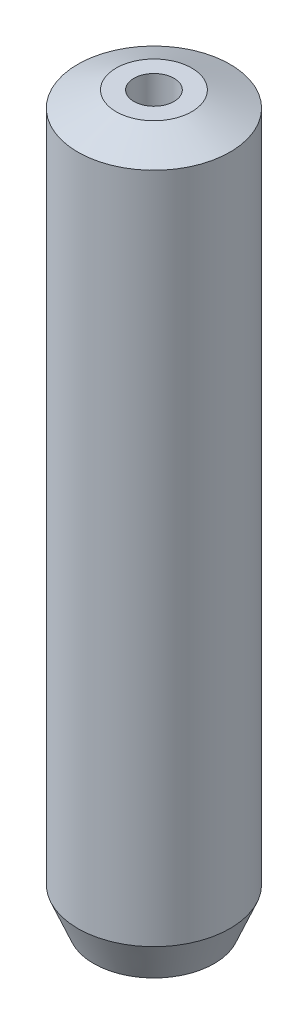
ISO-10303-21;
HEADER;
FILE_DESCRIPTION(('STEP AP214'),'2;1');
FILE_NAME('part.step','',(''),(''),'','','');
FILE_SCHEMA(('AUTOMOTIVE_DESIGN { 1 0 10303 214 1 1 1 1 }'));
ENDSEC;
DATA;
#1=APPLICATION_CONTEXT('core data for automotive mechanical design processes');
#2=APPLICATION_PROTOCOL_DEFINITION('international standard','automotive_design',2000,#1);
#3=PRODUCT_CONTEXT('',#1,'mechanical');
#4=PRODUCT('Part','Part','',(#3));
#5=PRODUCT_RELATED_PRODUCT_CATEGORY('part','',(#4));
#6=PRODUCT_DEFINITION_FORMATION('','',#4);
#7=PRODUCT_DEFINITION_CONTEXT('part definition',#1,'design');
#8=PRODUCT_DEFINITION('design','',#6,#7);
#9=PRODUCT_DEFINITION_SHAPE('','',#8);
#10=(LENGTH_UNIT() NAMED_UNIT(*) SI_UNIT(.MILLI.,.METRE.));
#11=(NAMED_UNIT(*) PLANE_ANGLE_UNIT() SI_UNIT($,.RADIAN.));
#12=(NAMED_UNIT(*) SI_UNIT($,.STERADIAN.) SOLID_ANGLE_UNIT());
#13=UNCERTAINTY_MEASURE_WITH_UNIT(LENGTH_MEASURE(1.E-05),#10,'distance_accuracy_value','');
#14=(GEOMETRIC_REPRESENTATION_CONTEXT(3) GLOBAL_UNCERTAINTY_ASSIGNED_CONTEXT((#13)) GLOBAL_UNIT_ASSIGNED_CONTEXT((#10,
#11,#12)) REPRESENTATION_CONTEXT('',''));
#15=CARTESIAN_POINT('',(0.,0.,0.));
#16=DIRECTION('',(0.,0.,1.));
#17=DIRECTION('',(1.,0.,0.));
#18=AXIS2_PLACEMENT_3D('',#15,#16,#17);
#19=CARTESIAN_POINT('',(0.,47.7138958191525,0.));
#20=DIRECTION('',(0.,-1.,0.));
#21=DIRECTION('',(0.,0.,-1.));
#22=AXIS2_PLACEMENT_3D('',#19,#20,#21);
#23=CYLINDRICAL_SURFACE('',#22,5.);
#24=CARTESIAN_POINT('',(0.,46.6743218122563,0.));
#25=DIRECTION('',(0.,1.,0.));
#26=DIRECTION('',(0.,0.,1.));
#27=AXIS2_PLACEMENT_3D('',#24,#25,#26);
#28=CIRCLE('',#27,5.);
#29=CARTESIAN_POINT('',(0.,46.6743218122563,5.));
#30=VERTEX_POINT('',#29);
#31=EDGE_CURVE('E50',#30,#30,#28,.F.);
#32=ORIENTED_EDGE('',*,*,#31,.T.);
#33=EDGE_LOOP('',(#32));
#34=FACE_BOUND('',#33,.T.);
#35=CARTESIAN_POINT('',(0.,2.51590091484068,0.));
#36=DIRECTION('',(0.,1.,0.));
#37=DIRECTION('',(0.,0.,1.));
#38=AXIS2_PLACEMENT_3D('',#35,#36,#37);
#39=CIRCLE('',#38,5.);
#40=CARTESIAN_POINT('',(0.,2.51590091484068,5.));
#41=VERTEX_POINT('',#40);
#42=EDGE_CURVE('E51',#41,#41,#39,.T.);
#43=ORIENTED_EDGE('',*,*,#42,.T.);
#44=EDGE_LOOP('',(#43));
#45=FACE_BOUND('',#44,.T.);
#46=ADVANCED_FACE('F39',(#34,#45),#23,.T.);
#47=CARTESIAN_POINT('',(0.,47.7138958191525,0.));
#48=DIRECTION('',(0.,1.,0.));
#49=DIRECTION('',(0.,0.,1.));
#50=AXIS2_PLACEMENT_3D('',#47,#48,#49);
#51=PLANE('',#50);
#52=CARTESIAN_POINT('',(0.,47.7138958191525,0.));
#53=DIRECTION('',(0.,1.,0.));
#54=DIRECTION('',(0.,0.,1.));
#55=AXIS2_PLACEMENT_3D('',#52,#53,#54);
#56=CIRCLE('',#55,2.48409908515933);
#57=CARTESIAN_POINT('',(0.,47.7138958191525,2.48409908515933));
#58=VERTEX_POINT('',#57);
#59=EDGE_CURVE('E54',#58,#58,#56,.T.);
#60=ORIENTED_EDGE('',*,*,#59,.T.);
#61=EDGE_LOOP('',(#60));
#62=FACE_BOUND('',#61,.T.);
#63=CARTESIAN_POINT('',(0.,47.7138958191525,0.));
#64=DIRECTION('',(0.,1.,0.));
#65=DIRECTION('',(0.,0.,1.));
#66=AXIS2_PLACEMENT_3D('',#63,#64,#65);
#67=CIRCLE('',#66,1.31939593534754);
#68=CARTESIAN_POINT('',(0.,47.7138958191525,1.31939593534754));
#69=VERTEX_POINT('',#68);
#70=EDGE_CURVE('E58',#69,#69,#67,.T.);
#71=ORIENTED_EDGE('',*,*,#70,.F.);
#72=EDGE_LOOP('',(#71));
#73=FACE_BOUND('',#72,.T.);
#74=ADVANCED_FACE('F69',(#62,#73),#51,.T.);
#75=CARTESIAN_POINT('',(0.,0.,0.));
#76=DIRECTION('',(0.,1.,0.));
#77=DIRECTION('',(0.,0.,1.));
#78=AXIS2_PLACEMENT_3D('',#75,#76,#77);
#79=PLANE('',#78);
#80=CARTESIAN_POINT('',(0.,0.,0.));
#81=DIRECTION('',(0.,1.,0.));
#82=DIRECTION('',(0.,0.,1.));
#83=AXIS2_PLACEMENT_3D('',#80,#81,#82);
#84=CIRCLE('',#83,3.96042599310382);
#85=CARTESIAN_POINT('',(0.,0.,3.96042599310382));
#86=VERTEX_POINT('',#85);
#87=EDGE_CURVE('E10',#86,#86,#84,.F.);
#88=ORIENTED_EDGE('',*,*,#87,.T.);
#89=EDGE_LOOP('',(#88));
#90=FACE_BOUND('',#89,.T.);
#91=CARTESIAN_POINT('',(0.,0.,0.));
#92=DIRECTION('',(0.,1.,0.));
#93=DIRECTION('',(0.,0.,1.));
#94=AXIS2_PLACEMENT_3D('',#91,#92,#93);
#95=CIRCLE('',#94,1.31939593534754);
#96=CARTESIAN_POINT('',(0.,0.,1.31939593534754));
#97=VERTEX_POINT('',#96);
#98=EDGE_CURVE('E63',#97,#97,#95,.T.);
#99=ORIENTED_EDGE('',*,*,#98,.T.);
#100=EDGE_LOOP('',(#99));
#101=FACE_BOUND('',#100,.T.);
#102=ADVANCED_FACE('F75',(#90,#101),#79,.F.);
#103=CARTESIAN_POINT('',(0.,47.7138958191525,0.));
#104=DIRECTION('',(0.,-1.,0.));
#105=DIRECTION('',(0.,0.,-1.));
#106=AXIS2_PLACEMENT_3D('',#103,#104,#105);
#107=CYLINDRICAL_SURFACE('',#106,1.31939593534754);
#108=ORIENTED_EDGE('',*,*,#70,.T.);
#109=EDGE_LOOP('',(#108));
#110=FACE_BOUND('',#109,.T.);
#111=ORIENTED_EDGE('',*,*,#98,.F.);
#112=EDGE_LOOP('',(#111));
#113=FACE_BOUND('',#112,.T.);
#114=ADVANCED_FACE('F70',(#110,#113),#107,.F.);
#115=CARTESIAN_POINT('',(0.,47.7138958191525,0.));
#116=DIRECTION('',(0.,-1.,0.));
#117=DIRECTION('',(0.,0.,-1.));
#118=AXIS2_PLACEMENT_3D('',#115,#116,#117);
#119=CONICAL_SURFACE('',#118,2.48409908515933,1.17896141183922);
#120=ORIENTED_EDGE('',*,*,#31,.F.);
#121=EDGE_LOOP('',(#120));
#122=FACE_BOUND('',#121,.T.);
#123=ORIENTED_EDGE('',*,*,#59,.F.);
#124=EDGE_LOOP('',(#123));
#125=FACE_BOUND('',#124,.T.);
#126=ADVANCED_FACE('F81',(#122,#125),#119,.T.);
#127=CARTESIAN_POINT('',(0.,2.51590091484068,0.));
#128=DIRECTION('',(0.,1.,0.));
#129=DIRECTION('',(0.,0.,1.));
#130=AXIS2_PLACEMENT_3D('',#127,#128,#129);
#131=CONICAL_SURFACE('',#130,5.,0.39183491495568);
#132=ORIENTED_EDGE('',*,*,#87,.F.);
#133=EDGE_LOOP('',(#132));
#134=FACE_BOUND('',#133,.T.);
#135=ORIENTED_EDGE('',*,*,#42,.F.);
#136=EDGE_LOOP('',(#135));
#137=FACE_BOUND('',#136,.T.);
#138=ADVANCED_FACE('F45',(#134,#137),#131,.T.);
#139=CLOSED_SHELL('',(#46,#74,#102,#114,#126,#138));
#140=MANIFOLD_SOLID_BREP('B2',#139);
#141=ADVANCED_BREP_SHAPE_REPRESENTATION('',(#18,#140),#14);
#142=SHAPE_DEFINITION_REPRESENTATION(#9,#141);
ENDSEC;
END-ISO-10303-21;
